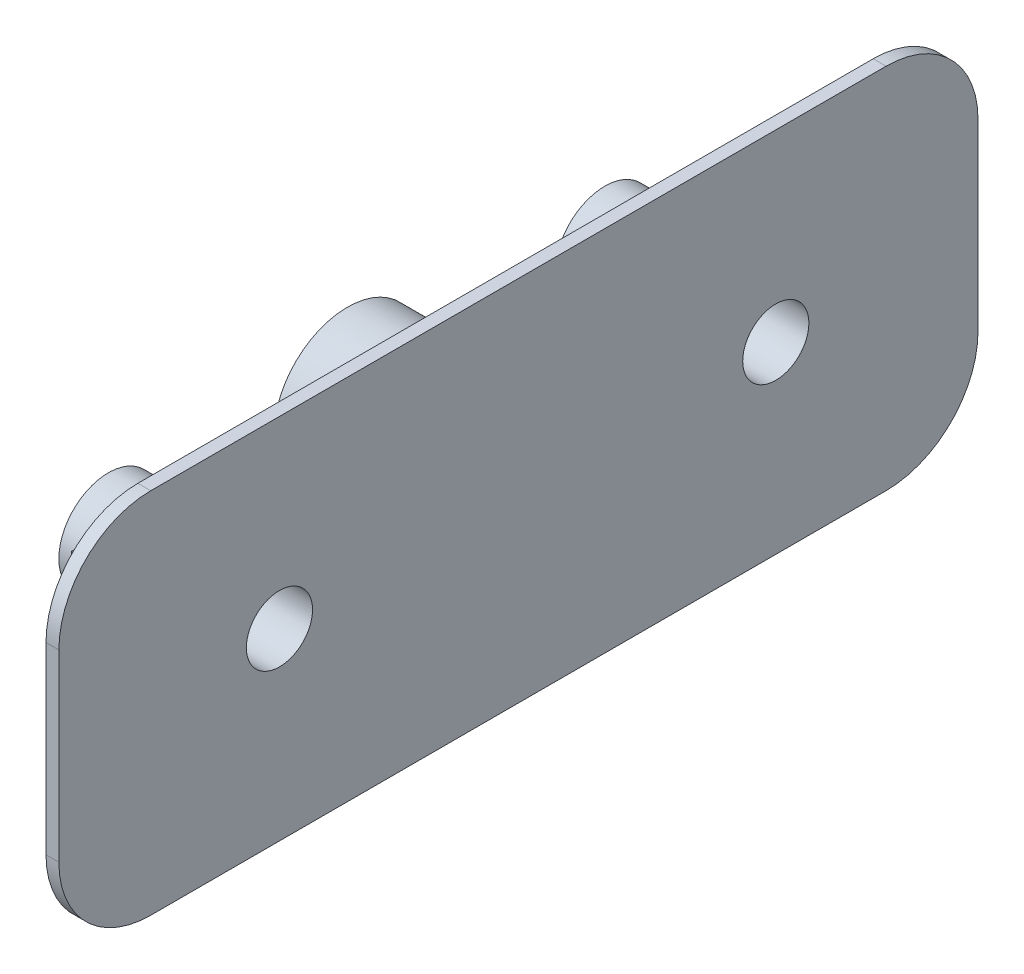
ISO-10303-21;
HEADER;
FILE_DESCRIPTION(('STEP AP214'),'2;1');
FILE_NAME('part.step','',(''),(''),'','','');
FILE_SCHEMA(('AUTOMOTIVE_DESIGN { 1 0 10303 214 1 1 1 1 }'));
ENDSEC;
DATA;
#1=APPLICATION_CONTEXT('core data for automotive mechanical design processes');
#2=APPLICATION_PROTOCOL_DEFINITION('international standard','automotive_design',2000,#1);
#3=PRODUCT_CONTEXT('',#1,'mechanical');
#4=PRODUCT('Part','Part','',(#3));
#5=PRODUCT_RELATED_PRODUCT_CATEGORY('part','',(#4));
#6=PRODUCT_DEFINITION_FORMATION('','',#4);
#7=PRODUCT_DEFINITION_CONTEXT('part definition',#1,'design');
#8=PRODUCT_DEFINITION('design','',#6,#7);
#9=PRODUCT_DEFINITION_SHAPE('','',#8);
#10=(LENGTH_UNIT() NAMED_UNIT(*) SI_UNIT(.MILLI.,.METRE.));
#11=(NAMED_UNIT(*) PLANE_ANGLE_UNIT() SI_UNIT($,.RADIAN.));
#12=(NAMED_UNIT(*) SI_UNIT($,.STERADIAN.) SOLID_ANGLE_UNIT());
#13=UNCERTAINTY_MEASURE_WITH_UNIT(LENGTH_MEASURE(1.E-05),#10,'distance_accuracy_value','');
#14=(GEOMETRIC_REPRESENTATION_CONTEXT(3) GLOBAL_UNCERTAINTY_ASSIGNED_CONTEXT((#13)) GLOBAL_UNIT_ASSIGNED_CONTEXT((#10,
#11,#12)) REPRESENTATION_CONTEXT('',''));
#15=CARTESIAN_POINT('',(0.,0.,0.));
#16=DIRECTION('',(0.,0.,1.));
#17=DIRECTION('',(1.,0.,0.));
#18=AXIS2_PLACEMENT_3D('',#15,#16,#17);
#19=CARTESIAN_POINT('',(5.,0.,0.));
#20=DIRECTION('',(-1.,0.,0.));
#21=DIRECTION('',(0.,0.,1.));
#22=AXIS2_PLACEMENT_3D('',#19,#20,#21);
#23=PLANE('',#22);
#24=CARTESIAN_POINT('',(5.,0.,-14.));
#25=DIRECTION('',(-1.,0.,0.));
#26=DIRECTION('',(0.,0.,1.));
#27=AXIS2_PLACEMENT_3D('',#24,#25,#26);
#28=CIRCLE('',#27,2.7);
#29=CARTESIAN_POINT('',(5.,0.,-11.3));
#30=VERTEX_POINT('',#29);
#31=EDGE_CURVE('E267',#30,#30,#28,.T.);
#32=ORIENTED_EDGE('',*,*,#31,.F.);
#33=EDGE_LOOP('',(#32));
#34=FACE_BOUND('',#33,.T.);
#35=CARTESIAN_POINT('',(5.,0.,0.));
#36=DIRECTION('',(1.,0.,0.));
#37=DIRECTION('',(0.,0.,-1.));
#38=AXIS2_PLACEMENT_3D('',#35,#36,#37);
#39=CIRCLE('',#38,4.);
#40=CARTESIAN_POINT('',(5.,0.,-4.));
#41=VERTEX_POINT('',#40);
#42=EDGE_CURVE('E176',#41,#41,#39,.T.);
#43=ORIENTED_EDGE('',*,*,#42,.T.);
#44=EDGE_LOOP('',(#43));
#45=FACE_BOUND('',#44,.T.);
#46=DIRECTION('',(0.,1.,0.));
#47=VECTOR('',#46,1.);
#48=CARTESIAN_POINT('',(5.,-5.,-20.));
#49=LINE('',#48,#47);
#50=CARTESIAN_POINT('',(5.,-5.,-20.));
#51=VERTEX_POINT('',#50);
#52=CARTESIAN_POINT('',(5.,5.,-20.));
#53=VERTEX_POINT('',#52);
#54=EDGE_CURVE('E159',#51,#53,#49,.T.);
#55=ORIENTED_EDGE('',*,*,#54,.F.);
#56=DIRECTION('',(0.,0.,-1.));
#57=VECTOR('',#56,1.);
#58=CARTESIAN_POINT('',(5.,-5.,20.));
#59=LINE('',#58,#57);
#60=CARTESIAN_POINT('',(5.,-5.,20.));
#61=VERTEX_POINT('',#60);
#62=EDGE_CURVE('E140',#61,#51,#59,.T.);
#63=ORIENTED_EDGE('',*,*,#62,.F.);
#64=DIRECTION('',(0.,-1.,0.));
#65=VECTOR('',#64,1.);
#66=CARTESIAN_POINT('',(5.,-5.,20.));
#67=LINE('',#66,#65);
#68=CARTESIAN_POINT('',(5.,5.,20.));
#69=VERTEX_POINT('',#68);
#70=EDGE_CURVE('E164',#69,#61,#67,.T.);
#71=ORIENTED_EDGE('',*,*,#70,.F.);
#72=DIRECTION('',(0.,0.,1.));
#73=VECTOR('',#72,1.);
#74=CARTESIAN_POINT('',(5.,5.,20.));
#75=LINE('',#74,#73);
#76=EDGE_CURVE('E161',#53,#69,#75,.T.);
#77=ORIENTED_EDGE('',*,*,#76,.F.);
#78=EDGE_LOOP('',(#55,#63,#71,#77));
#79=FACE_BOUND('',#78,.T.);
#80=CARTESIAN_POINT('',(5.,0.,13.));
#81=DIRECTION('',(-1.,0.,0.));
#82=DIRECTION('',(0.,0.,1.));
#83=AXIS2_PLACEMENT_3D('',#80,#81,#82);
#84=CIRCLE('',#83,2.7);
#85=CARTESIAN_POINT('',(5.,0.,15.7));
#86=VERTEX_POINT('',#85);
#87=EDGE_CURVE('E254',#86,#86,#84,.T.);
#88=ORIENTED_EDGE('',*,*,#87,.F.);
#89=EDGE_LOOP('',(#88));
#90=FACE_BOUND('',#89,.T.);
#91=ADVANCED_FACE('F37',(#34,#45,#79,#90),#23,.T.);
#92=CARTESIAN_POINT('',(0.,0.,0.));
#93=DIRECTION('',(1.,0.,0.));
#94=DIRECTION('',(0.,0.,-1.));
#95=AXIS2_PLACEMENT_3D('',#92,#93,#94);
#96=PLANE('',#95);
#97=CARTESIAN_POINT('',(0.,0.,0.));
#98=DIRECTION('',(1.,0.,0.));
#99=DIRECTION('',(0.,0.,-1.));
#100=AXIS2_PLACEMENT_3D('',#97,#98,#99);
#101=CIRCLE('',#100,4.);
#102=CARTESIAN_POINT('',(0.,0.,-4.));
#103=VERTEX_POINT('',#102);
#104=EDGE_CURVE('E175',#103,#103,#101,.T.);
#105=ORIENTED_EDGE('',*,*,#104,.F.);
#106=EDGE_LOOP('',(#105));
#107=FACE_BOUND('',#106,.T.);
#108=CARTESIAN_POINT('',(0.,0.,0.));
#109=DIRECTION('',(1.,0.,0.));
#110=DIRECTION('',(0.,0.,-1.));
#111=AXIS2_PLACEMENT_3D('',#108,#109,#110);
#112=CIRCLE('',#111,3.);
#113=CARTESIAN_POINT('',(0.,0.,-3.));
#114=VERTEX_POINT('',#113);
#115=EDGE_CURVE('E172',#114,#114,#112,.T.);
#116=ORIENTED_EDGE('',*,*,#115,.T.);
#117=EDGE_LOOP('',(#116));
#118=FACE_BOUND('',#117,.T.);
#119=ADVANCED_FACE('F249',(#107,#118),#96,.F.);
#120=CARTESIAN_POINT('',(5.,0.,0.));
#121=DIRECTION('',(-1.,0.,0.));
#122=DIRECTION('',(0.,0.,1.));
#123=AXIS2_PLACEMENT_3D('',#120,#121,#122);
#124=CYLINDRICAL_SURFACE('',#123,4.);
#125=ORIENTED_EDGE('',*,*,#42,.F.);
#126=EDGE_LOOP('',(#125));
#127=FACE_BOUND('',#126,.T.);
#128=ORIENTED_EDGE('',*,*,#104,.T.);
#129=EDGE_LOOP('',(#128));
#130=FACE_BOUND('',#129,.T.);
#131=ADVANCED_FACE('F310',(#127,#130),#124,.T.);
#132=CARTESIAN_POINT('',(5.,0.,0.));
#133=DIRECTION('',(-1.,0.,0.));
#134=DIRECTION('',(0.,0.,1.));
#135=AXIS2_PLACEMENT_3D('',#132,#133,#134);
#136=CYLINDRICAL_SURFACE('',#135,3.);
#137=ORIENTED_EDGE('',*,*,#115,.F.);
#138=EDGE_LOOP('',(#137));
#139=FACE_BOUND('',#138,.T.);
#140=CARTESIAN_POINT('',(8.6,0.,0.));
#141=DIRECTION('',(1.,0.,0.));
#142=DIRECTION('',(0.,0.,-1.));
#143=AXIS2_PLACEMENT_3D('',#140,#141,#142);
#144=CIRCLE('',#143,3.);
#145=CARTESIAN_POINT('',(8.6,0.,-3.));
#146=VERTEX_POINT('',#145);
#147=EDGE_CURVE('E162',#146,#146,#144,.T.);
#148=ORIENTED_EDGE('',*,*,#147,.T.);
#149=EDGE_LOOP('',(#148));
#150=FACE_BOUND('',#149,.T.);
#151=ADVANCED_FACE('F339',(#139,#150),#136,.F.);
#152=CARTESIAN_POINT('',(8.6,-5.,-20.));
#153=DIRECTION('',(0.,0.,1.));
#154=DIRECTION('',(1.,0.,0.));
#155=AXIS2_PLACEMENT_3D('',#152,#153,#154);
#156=PLANE('',#155);
#157=ORIENTED_EDGE('',*,*,#54,.T.);
#158=DIRECTION('',(-1.,0.,0.));
#159=VECTOR('',#158,1.);
#160=CARTESIAN_POINT('',(8.6,5.,-20.));
#161=LINE('',#160,#159);
#162=CARTESIAN_POINT('',(8.6,5.,-20.));
#163=VERTEX_POINT('',#162);
#164=EDGE_CURVE('E135',#163,#53,#161,.T.);
#165=ORIENTED_EDGE('',*,*,#164,.F.);
#166=DIRECTION('',(0.,1.,0.));
#167=VECTOR('',#166,1.);
#168=CARTESIAN_POINT('',(8.6,-5.,-20.));
#169=LINE('',#168,#167);
#170=CARTESIAN_POINT('',(8.6,-5.,-20.));
#171=VERTEX_POINT('',#170);
#172=EDGE_CURVE('E128',#171,#163,#169,.T.);
#173=ORIENTED_EDGE('',*,*,#172,.F.);
#174=DIRECTION('',(-1.,0.,0.));
#175=VECTOR('',#174,1.);
#176=CARTESIAN_POINT('',(8.6,-5.,-20.));
#177=LINE('',#176,#175);
#178=EDGE_CURVE('E132',#171,#51,#177,.T.);
#179=ORIENTED_EDGE('',*,*,#178,.T.);
#180=EDGE_LOOP('',(#157,#165,#173,#179));
#181=FACE_BOUND('',#180,.T.);
#182=ADVANCED_FACE('F131',(#181),#156,.F.);
#183=CARTESIAN_POINT('',(8.6,5.,20.));
#184=DIRECTION('',(0.,-1.,0.));
#185=DIRECTION('',(0.,0.,-1.));
#186=AXIS2_PLACEMENT_3D('',#183,#184,#185);
#187=PLANE('',#186);
#188=ORIENTED_EDGE('',*,*,#76,.T.);
#189=DIRECTION('',(-1.,0.,0.));
#190=VECTOR('',#189,1.);
#191=CARTESIAN_POINT('',(8.6,5.,20.));
#192=LINE('',#191,#190);
#193=CARTESIAN_POINT('',(8.6,5.,20.));
#194=VERTEX_POINT('',#193);
#195=EDGE_CURVE('E168',#194,#69,#192,.T.);
#196=ORIENTED_EDGE('',*,*,#195,.F.);
#197=DIRECTION('',(0.,0.,1.));
#198=VECTOR('',#197,1.);
#199=CARTESIAN_POINT('',(8.6,5.,20.));
#200=LINE('',#199,#198);
#201=EDGE_CURVE('E139',#163,#194,#200,.T.);
#202=ORIENTED_EDGE('',*,*,#201,.F.);
#203=ORIENTED_EDGE('',*,*,#164,.T.);
#204=EDGE_LOOP('',(#188,#196,#202,#203));
#205=FACE_BOUND('',#204,.T.);
#206=ADVANCED_FACE('F242',(#205),#187,.F.);
#207=CARTESIAN_POINT('',(8.6,-5.,20.));
#208=DIRECTION('',(0.,0.,-1.));
#209=DIRECTION('',(-1.,0.,0.));
#210=AXIS2_PLACEMENT_3D('',#207,#208,#209);
#211=PLANE('',#210);
#212=ORIENTED_EDGE('',*,*,#70,.T.);
#213=DIRECTION('',(-1.,0.,0.));
#214=VECTOR('',#213,1.);
#215=CARTESIAN_POINT('',(8.6,-5.,20.));
#216=LINE('',#215,#214);
#217=CARTESIAN_POINT('',(8.6,-5.,20.));
#218=VERTEX_POINT('',#217);
#219=EDGE_CURVE('E149',#218,#61,#216,.T.);
#220=ORIENTED_EDGE('',*,*,#219,.F.);
#221=DIRECTION('',(0.,-1.,0.));
#222=VECTOR('',#221,1.);
#223=CARTESIAN_POINT('',(8.6,-5.,20.));
#224=LINE('',#223,#222);
#225=EDGE_CURVE('E154',#194,#218,#224,.T.);
#226=ORIENTED_EDGE('',*,*,#225,.F.);
#227=ORIENTED_EDGE('',*,*,#195,.T.);
#228=EDGE_LOOP('',(#212,#220,#226,#227));
#229=FACE_BOUND('',#228,.T.);
#230=ADVANCED_FACE('F245',(#229),#211,.F.);
#231=CARTESIAN_POINT('',(8.6,-5.,20.));
#232=DIRECTION('',(0.,1.,0.));
#233=DIRECTION('',(0.,0.,1.));
#234=AXIS2_PLACEMENT_3D('',#231,#232,#233);
#235=PLANE('',#234);
#236=ORIENTED_EDGE('',*,*,#62,.T.);
#237=ORIENTED_EDGE('',*,*,#178,.F.);
#238=DIRECTION('',(0.,0.,-1.));
#239=VECTOR('',#238,1.);
#240=CARTESIAN_POINT('',(8.6,-5.,20.));
#241=LINE('',#240,#239);
#242=EDGE_CURVE('E146',#218,#171,#241,.T.);
#243=ORIENTED_EDGE('',*,*,#242,.F.);
#244=ORIENTED_EDGE('',*,*,#219,.T.);
#245=EDGE_LOOP('',(#236,#237,#243,#244));
#246=FACE_BOUND('',#245,.T.);
#247=ADVANCED_FACE('F144',(#246),#235,.F.);
#248=CARTESIAN_POINT('',(8.6,0.,0.));
#249=DIRECTION('',(1.,0.,0.));
#250=DIRECTION('',(0.,0.,-1.));
#251=AXIS2_PLACEMENT_3D('',#248,#249,#250);
#252=PLANE('',#251);
#253=ORIENTED_EDGE('',*,*,#147,.F.);
#254=EDGE_LOOP('',(#253));
#255=FACE_BOUND('',#254,.T.);
#256=ADVANCED_FACE('F327',(#255),#252,.F.);
#257=CARTESIAN_POINT('',(9.3,-10.,25.));
#258=DIRECTION('',(0.,0.,-1.));
#259=DIRECTION('',(-1.,0.,0.));
#260=AXIS2_PLACEMENT_3D('',#257,#258,#259);
#261=PLANE('',#260);
#262=DIRECTION('',(0.,-1.,0.));
#263=VECTOR('',#262,1.);
#264=CARTESIAN_POINT('',(8.6,-10.,25.));
#265=LINE('',#264,#263);
#266=CARTESIAN_POINT('',(8.6,5.,25.));
#267=VERTEX_POINT('',#266);
#268=CARTESIAN_POINT('',(8.6,-5.,25.));
#269=VERTEX_POINT('',#268);
#270=EDGE_CURVE('E216',#267,#269,#265,.T.);
#271=ORIENTED_EDGE('',*,*,#270,.T.);
#272=DIRECTION('',(-1.,0.,0.));
#273=VECTOR('',#272,1.);
#274=CARTESIAN_POINT('',(9.3,-5.,25.));
#275=LINE('',#274,#273);
#276=CARTESIAN_POINT('',(9.3,-5.,25.));
#277=VERTEX_POINT('',#276);
#278=EDGE_CURVE('E11',#269,#277,#275,.F.);
#279=ORIENTED_EDGE('',*,*,#278,.T.);
#280=DIRECTION('',(0.,-1.,0.));
#281=VECTOR('',#280,1.);
#282=CARTESIAN_POINT('',(9.3,-10.,25.));
#283=LINE('',#282,#281);
#284=CARTESIAN_POINT('',(9.3,5.,25.));
#285=VERTEX_POINT('',#284);
#286=EDGE_CURVE('E218',#285,#277,#283,.T.);
#287=ORIENTED_EDGE('',*,*,#286,.F.);
#288=DIRECTION('',(-1.,0.,0.));
#289=VECTOR('',#288,1.);
#290=CARTESIAN_POINT('',(9.3,5.,25.));
#291=LINE('',#290,#289);
#292=EDGE_CURVE('E45',#285,#267,#291,.T.);
#293=ORIENTED_EDGE('',*,*,#292,.T.);
#294=EDGE_LOOP('',(#271,#279,#287,#293));
#295=FACE_BOUND('',#294,.T.);
#296=ADVANCED_FACE('F215',(#295),#261,.F.);
#297=CARTESIAN_POINT('',(9.3,-10.,-25.));
#298=DIRECTION('',(0.,1.,0.));
#299=DIRECTION('',(0.,0.,1.));
#300=AXIS2_PLACEMENT_3D('',#297,#298,#299);
#301=PLANE('',#300);
#302=DIRECTION('',(0.,0.,-1.));
#303=VECTOR('',#302,1.);
#304=CARTESIAN_POINT('',(8.6,-10.,-25.));
#305=LINE('',#304,#303);
#306=CARTESIAN_POINT('',(8.6,-10.,20.));
#307=VERTEX_POINT('',#306);
#308=CARTESIAN_POINT('',(8.6,-10.,-20.));
#309=VERTEX_POINT('',#308);
#310=EDGE_CURVE('E224',#307,#309,#305,.T.);
#311=ORIENTED_EDGE('',*,*,#310,.T.);
#312=DIRECTION('',(-1.,0.,0.));
#313=VECTOR('',#312,1.);
#314=CARTESIAN_POINT('',(9.3,-10.,-20.));
#315=LINE('',#314,#313);
#316=CARTESIAN_POINT('',(9.3,-10.,-20.));
#317=VERTEX_POINT('',#316);
#318=EDGE_CURVE('E52',#309,#317,#315,.F.);
#319=ORIENTED_EDGE('',*,*,#318,.T.);
#320=DIRECTION('',(0.,0.,-1.));
#321=VECTOR('',#320,1.);
#322=CARTESIAN_POINT('',(9.3,-10.,-25.));
#323=LINE('',#322,#321);
#324=CARTESIAN_POINT('',(9.3,-10.,20.));
#325=VERTEX_POINT('',#324);
#326=EDGE_CURVE('E276',#325,#317,#323,.T.);
#327=ORIENTED_EDGE('',*,*,#326,.F.);
#328=DIRECTION('',(-1.,0.,0.));
#329=VECTOR('',#328,1.);
#330=CARTESIAN_POINT('',(9.3,-10.,20.));
#331=LINE('',#330,#329);
#332=EDGE_CURVE('E206',#325,#307,#331,.T.);
#333=ORIENTED_EDGE('',*,*,#332,.T.);
#334=EDGE_LOOP('',(#311,#319,#327,#333));
#335=FACE_BOUND('',#334,.T.);
#336=ADVANCED_FACE('F318',(#335),#301,.F.);
#337=CARTESIAN_POINT('',(9.3,-10.,-25.));
#338=DIRECTION('',(0.,0.,1.));
#339=DIRECTION('',(1.,0.,0.));
#340=AXIS2_PLACEMENT_3D('',#337,#338,#339);
#341=PLANE('',#340);
#342=DIRECTION('',(0.,1.,0.));
#343=VECTOR('',#342,1.);
#344=CARTESIAN_POINT('',(8.6,-10.,-25.));
#345=LINE('',#344,#343);
#346=CARTESIAN_POINT('',(8.6,-5.,-25.));
#347=VERTEX_POINT('',#346);
#348=CARTESIAN_POINT('',(8.6,5.,-25.));
#349=VERTEX_POINT('',#348);
#350=EDGE_CURVE('E227',#347,#349,#345,.T.);
#351=ORIENTED_EDGE('',*,*,#350,.T.);
#352=DIRECTION('',(-1.,0.,0.));
#353=VECTOR('',#352,1.);
#354=CARTESIAN_POINT('',(9.3,5.,-25.));
#355=LINE('',#354,#353);
#356=CARTESIAN_POINT('',(9.3,5.,-25.));
#357=VERTEX_POINT('',#356);
#358=EDGE_CURVE('E197',#349,#357,#355,.F.);
#359=ORIENTED_EDGE('',*,*,#358,.T.);
#360=DIRECTION('',(0.,1.,0.));
#361=VECTOR('',#360,1.);
#362=CARTESIAN_POINT('',(9.3,-10.,-25.));
#363=LINE('',#362,#361);
#364=CARTESIAN_POINT('',(9.3,-5.,-25.));
#365=VERTEX_POINT('',#364);
#366=EDGE_CURVE('E277',#365,#357,#363,.T.);
#367=ORIENTED_EDGE('',*,*,#366,.F.);
#368=DIRECTION('',(-1.,0.,0.));
#369=VECTOR('',#368,1.);
#370=CARTESIAN_POINT('',(9.3,-5.,-25.));
#371=LINE('',#370,#369);
#372=EDGE_CURVE('E194',#365,#347,#371,.T.);
#373=ORIENTED_EDGE('',*,*,#372,.T.);
#374=EDGE_LOOP('',(#351,#359,#367,#373));
#375=FACE_BOUND('',#374,.T.);
#376=ADVANCED_FACE('F292',(#375),#341,.F.);
#377=CARTESIAN_POINT('',(9.3,10.,-25.));
#378=DIRECTION('',(0.,-1.,0.));
#379=DIRECTION('',(0.,0.,-1.));
#380=AXIS2_PLACEMENT_3D('',#377,#378,#379);
#381=PLANE('',#380);
#382=DIRECTION('',(0.,0.,1.));
#383=VECTOR('',#382,1.);
#384=CARTESIAN_POINT('',(9.3,10.,-25.));
#385=LINE('',#384,#383);
#386=CARTESIAN_POINT('',(9.3,10.,-20.));
#387=VERTEX_POINT('',#386);
#388=CARTESIAN_POINT('',(9.3,9.99999999999999,20.));
#389=VERTEX_POINT('',#388);
#390=EDGE_CURVE('E233',#387,#389,#385,.T.);
#391=ORIENTED_EDGE('',*,*,#390,.F.);
#392=DIRECTION('',(-1.,0.,0.));
#393=VECTOR('',#392,1.);
#394=CARTESIAN_POINT('',(9.3,10.,-20.));
#395=LINE('',#394,#393);
#396=CARTESIAN_POINT('',(8.6,10.,-20.));
#397=VERTEX_POINT('',#396);
#398=EDGE_CURVE('E183',#387,#397,#395,.T.);
#399=ORIENTED_EDGE('',*,*,#398,.T.);
#400=DIRECTION('',(0.,0.,1.));
#401=VECTOR('',#400,1.);
#402=CARTESIAN_POINT('',(8.6,10.,-25.));
#403=LINE('',#402,#401);
#404=CARTESIAN_POINT('',(8.6,9.99999999999999,20.));
#405=VERTEX_POINT('',#404);
#406=EDGE_CURVE('E238',#397,#405,#403,.T.);
#407=ORIENTED_EDGE('',*,*,#406,.T.);
#408=DIRECTION('',(-1.,0.,0.));
#409=VECTOR('',#408,1.);
#410=CARTESIAN_POINT('',(9.3,9.99999999999999,20.));
#411=LINE('',#410,#409);
#412=EDGE_CURVE('E179',#405,#389,#411,.F.);
#413=ORIENTED_EDGE('',*,*,#412,.T.);
#414=EDGE_LOOP('',(#391,#399,#407,#413));
#415=FACE_BOUND('',#414,.T.);
#416=ADVANCED_FACE('F287',(#415),#381,.F.);
#417=CARTESIAN_POINT('',(9.3,0.,0.));
#418=DIRECTION('',(1.,0.,0.));
#419=DIRECTION('',(0.,0.,-1.));
#420=AXIS2_PLACEMENT_3D('',#417,#418,#419);
#421=PLANE('',#420);
#422=CARTESIAN_POINT('',(9.3,0.,-14.));
#423=DIRECTION('',(1.,0.,0.));
#424=DIRECTION('',(0.,0.,-1.));
#425=AXIS2_PLACEMENT_3D('',#422,#423,#424);
#426=CIRCLE('',#425,1.8);
#427=CARTESIAN_POINT('',(9.3,0.,-15.8));
#428=VERTEX_POINT('',#427);
#429=EDGE_CURVE('E230',#428,#428,#426,.T.);
#430=ORIENTED_EDGE('',*,*,#429,.F.);
#431=EDGE_LOOP('',(#430));
#432=FACE_BOUND('',#431,.T.);
#433=CARTESIAN_POINT('',(9.3,0.,13.));
#434=DIRECTION('',(1.,0.,0.));
#435=DIRECTION('',(0.,0.,-1.));
#436=AXIS2_PLACEMENT_3D('',#433,#434,#435);
#437=CIRCLE('',#436,1.8);
#438=CARTESIAN_POINT('',(9.3,0.,11.2));
#439=VERTEX_POINT('',#438);
#440=EDGE_CURVE('E225',#439,#439,#437,.T.);
#441=ORIENTED_EDGE('',*,*,#440,.F.);
#442=EDGE_LOOP('',(#441));
#443=FACE_BOUND('',#442,.T.);
#444=ORIENTED_EDGE('',*,*,#366,.T.);
#445=CARTESIAN_POINT('',(9.3,5.,-20.));
#446=DIRECTION('',(1.,0.,0.));
#447=DIRECTION('',(0.,0.,-1.));
#448=AXIS2_PLACEMENT_3D('',#445,#446,#447);
#449=CIRCLE('',#448,5.);
#450=EDGE_CURVE('E204',#357,#387,#449,.T.);
#451=ORIENTED_EDGE('',*,*,#450,.T.);
#452=ORIENTED_EDGE('',*,*,#390,.T.);
#453=CARTESIAN_POINT('',(9.3,5.,20.));
#454=DIRECTION('',(1.,0.,0.));
#455=DIRECTION('',(0.,0.,-1.));
#456=AXIS2_PLACEMENT_3D('',#453,#454,#455);
#457=CIRCLE('',#456,5.);
#458=EDGE_CURVE('E199',#389,#285,#457,.T.);
#459=ORIENTED_EDGE('',*,*,#458,.T.);
#460=ORIENTED_EDGE('',*,*,#286,.T.);
#461=CARTESIAN_POINT('',(9.3,-5.,20.));
#462=DIRECTION('',(1.,0.,0.));
#463=DIRECTION('',(0.,0.,-1.));
#464=AXIS2_PLACEMENT_3D('',#461,#462,#463);
#465=CIRCLE('',#464,5.);
#466=EDGE_CURVE('E59',#277,#325,#465,.T.);
#467=ORIENTED_EDGE('',*,*,#466,.T.);
#468=ORIENTED_EDGE('',*,*,#326,.T.);
#469=CARTESIAN_POINT('',(9.3,-5.,-20.));
#470=DIRECTION('',(1.,0.,0.));
#471=DIRECTION('',(0.,0.,-1.));
#472=AXIS2_PLACEMENT_3D('',#469,#470,#471);
#473=CIRCLE('',#472,5.);
#474=EDGE_CURVE('E202',#317,#365,#473,.T.);
#475=ORIENTED_EDGE('',*,*,#474,.T.);
#476=EDGE_LOOP('',(#444,#451,#452,#459,#460,#467,#468,#475));
#477=FACE_BOUND('',#476,.T.);
#478=ADVANCED_FACE('F283',(#432,#443,#477),#421,.T.);
#479=ORIENTED_EDGE('',*,*,#242,.T.);
#480=ORIENTED_EDGE('',*,*,#172,.T.);
#481=ORIENTED_EDGE('',*,*,#201,.T.);
#482=ORIENTED_EDGE('',*,*,#225,.T.);
#483=EDGE_LOOP('',(#479,#480,#481,#482));
#484=FACE_BOUND('',#483,.T.);
#485=ORIENTED_EDGE('',*,*,#406,.F.);
#486=CARTESIAN_POINT('',(8.6,5.,-20.));
#487=DIRECTION('',(1.,0.,0.));
#488=DIRECTION('',(0.,0.,-1.));
#489=AXIS2_PLACEMENT_3D('',#486,#487,#488);
#490=CIRCLE('',#489,5.);
#491=EDGE_CURVE('E192',#397,#349,#490,.F.);
#492=ORIENTED_EDGE('',*,*,#491,.T.);
#493=ORIENTED_EDGE('',*,*,#350,.F.);
#494=CARTESIAN_POINT('',(8.6,-5.,-20.));
#495=DIRECTION('',(1.,0.,0.));
#496=DIRECTION('',(0.,0.,-1.));
#497=AXIS2_PLACEMENT_3D('',#494,#495,#496);
#498=CIRCLE('',#497,5.);
#499=EDGE_CURVE('E190',#347,#309,#498,.F.);
#500=ORIENTED_EDGE('',*,*,#499,.T.);
#501=ORIENTED_EDGE('',*,*,#310,.F.);
#502=CARTESIAN_POINT('',(8.6,-5.,20.));
#503=DIRECTION('',(1.,0.,0.));
#504=DIRECTION('',(0.,0.,-1.));
#505=AXIS2_PLACEMENT_3D('',#502,#503,#504);
#506=CIRCLE('',#505,5.);
#507=EDGE_CURVE('E188',#307,#269,#506,.F.);
#508=ORIENTED_EDGE('',*,*,#507,.T.);
#509=ORIENTED_EDGE('',*,*,#270,.F.);
#510=CARTESIAN_POINT('',(8.6,5.,20.));
#511=DIRECTION('',(1.,0.,0.));
#512=DIRECTION('',(0.,0.,-1.));
#513=AXIS2_PLACEMENT_3D('',#510,#511,#512);
#514=CIRCLE('',#513,5.);
#515=EDGE_CURVE('E186',#267,#405,#514,.F.);
#516=ORIENTED_EDGE('',*,*,#515,.T.);
#517=EDGE_LOOP('',(#485,#492,#493,#500,#501,#508,#509,#516));
#518=FACE_BOUND('',#517,.T.);
#519=ADVANCED_FACE('F151',(#484,#518),#252,.F.);
#520=CARTESIAN_POINT('',(5.,0.,13.));
#521=DIRECTION('',(-1.,0.,0.));
#522=DIRECTION('',(0.,0.,1.));
#523=AXIS2_PLACEMENT_3D('',#520,#521,#522);
#524=CYLINDRICAL_SURFACE('',#523,1.8);
#525=ORIENTED_EDGE('',*,*,#440,.T.);
#526=EDGE_LOOP('',(#525));
#527=FACE_BOUND('',#526,.T.);
#528=CARTESIAN_POINT('',(0.,0.,13.));
#529=DIRECTION('',(-1.,0.,0.));
#530=DIRECTION('',(0.,0.,1.));
#531=AXIS2_PLACEMENT_3D('',#528,#529,#530);
#532=CIRCLE('',#531,1.8);
#533=CARTESIAN_POINT('',(0.,0.,14.8));
#534=VERTEX_POINT('',#533);
#535=EDGE_CURVE('E256',#534,#534,#532,.T.);
#536=ORIENTED_EDGE('',*,*,#535,.T.);
#537=EDGE_LOOP('',(#536));
#538=FACE_BOUND('',#537,.T.);
#539=ADVANCED_FACE('F360',(#527,#538),#524,.F.);
#540=CARTESIAN_POINT('',(5.,0.,-14.));
#541=DIRECTION('',(-1.,0.,0.));
#542=DIRECTION('',(0.,0.,1.));
#543=AXIS2_PLACEMENT_3D('',#540,#541,#542);
#544=CYLINDRICAL_SURFACE('',#543,1.8);
#545=ORIENTED_EDGE('',*,*,#429,.T.);
#546=EDGE_LOOP('',(#545));
#547=FACE_BOUND('',#546,.T.);
#548=CARTESIAN_POINT('',(0.,0.,-14.));
#549=DIRECTION('',(-1.,0.,0.));
#550=DIRECTION('',(0.,0.,1.));
#551=AXIS2_PLACEMENT_3D('',#548,#549,#550);
#552=CIRCLE('',#551,1.8);
#553=CARTESIAN_POINT('',(0.,0.,-12.2));
#554=VERTEX_POINT('',#553);
#555=EDGE_CURVE('E260',#554,#554,#552,.T.);
#556=ORIENTED_EDGE('',*,*,#555,.T.);
#557=EDGE_LOOP('',(#556));
#558=FACE_BOUND('',#557,.T.);
#559=ADVANCED_FACE('F365',(#547,#558),#544,.F.);
#560=CARTESIAN_POINT('',(0.,0.,-14.));
#561=DIRECTION('',(-1.,0.,0.));
#562=DIRECTION('',(0.,0.,1.));
#563=AXIS2_PLACEMENT_3D('',#560,#561,#562);
#564=PLANE('',#563);
#565=CARTESIAN_POINT('',(0.,0.,-14.));
#566=DIRECTION('',(-1.,0.,0.));
#567=DIRECTION('',(0.,0.,1.));
#568=AXIS2_PLACEMENT_3D('',#565,#566,#567);
#569=CIRCLE('',#568,2.7);
#570=CARTESIAN_POINT('',(0.,0.,-11.3));
#571=VERTEX_POINT('',#570);
#572=EDGE_CURVE('E268',#571,#571,#569,.T.);
#573=ORIENTED_EDGE('',*,*,#572,.T.);
#574=EDGE_LOOP('',(#573));
#575=FACE_BOUND('',#574,.T.);
#576=ORIENTED_EDGE('',*,*,#555,.F.);
#577=EDGE_LOOP('',(#576));
#578=FACE_BOUND('',#577,.T.);
#579=ADVANCED_FACE('F377',(#575,#578),#564,.T.);
#580=CARTESIAN_POINT('',(0.,0.,-14.));
#581=DIRECTION('',(1.,0.,0.));
#582=DIRECTION('',(0.,0.,-1.));
#583=AXIS2_PLACEMENT_3D('',#580,#581,#582);
#584=CYLINDRICAL_SURFACE('',#583,2.7);
#585=ORIENTED_EDGE('',*,*,#572,.F.);
#586=EDGE_LOOP('',(#585));
#587=FACE_BOUND('',#586,.T.);
#588=ORIENTED_EDGE('',*,*,#31,.T.);
#589=EDGE_LOOP('',(#588));
#590=FACE_BOUND('',#589,.T.);
#591=ADVANCED_FACE('F379',(#587,#590),#584,.T.);
#592=CARTESIAN_POINT('',(0.,0.,13.));
#593=DIRECTION('',(-1.,0.,0.));
#594=DIRECTION('',(0.,0.,1.));
#595=AXIS2_PLACEMENT_3D('',#592,#593,#594);
#596=PLANE('',#595);
#597=CARTESIAN_POINT('',(0.,0.,13.));
#598=DIRECTION('',(-1.,0.,0.));
#599=DIRECTION('',(0.,0.,1.));
#600=AXIS2_PLACEMENT_3D('',#597,#598,#599);
#601=CIRCLE('',#600,2.7);
#602=CARTESIAN_POINT('',(0.,0.,15.7));
#603=VERTEX_POINT('',#602);
#604=EDGE_CURVE('E257',#603,#603,#601,.T.);
#605=ORIENTED_EDGE('',*,*,#604,.T.);
#606=EDGE_LOOP('',(#605));
#607=FACE_BOUND('',#606,.T.);
#608=ORIENTED_EDGE('',*,*,#535,.F.);
#609=EDGE_LOOP('',(#608));
#610=FACE_BOUND('',#609,.T.);
#611=ADVANCED_FACE('F306',(#607,#610),#596,.T.);
#612=CARTESIAN_POINT('',(0.,0.,13.));
#613=DIRECTION('',(1.,0.,0.));
#614=DIRECTION('',(0.,0.,-1.));
#615=AXIS2_PLACEMENT_3D('',#612,#613,#614);
#616=CYLINDRICAL_SURFACE('',#615,2.7);
#617=ORIENTED_EDGE('',*,*,#604,.F.);
#618=EDGE_LOOP('',(#617));
#619=FACE_BOUND('',#618,.T.);
#620=ORIENTED_EDGE('',*,*,#87,.T.);
#621=EDGE_LOOP('',(#620));
#622=FACE_BOUND('',#621,.T.);
#623=ADVANCED_FACE('F297',(#619,#622),#616,.T.);
#624=CARTESIAN_POINT('',(9.3,5.,-20.));
#625=DIRECTION('',(-1.,0.,0.));
#626=DIRECTION('',(0.,0.,1.));
#627=AXIS2_PLACEMENT_3D('',#624,#625,#626);
#628=CYLINDRICAL_SURFACE('',#627,5.);
#629=ORIENTED_EDGE('',*,*,#450,.F.);
#630=ORIENTED_EDGE('',*,*,#358,.F.);
#631=ORIENTED_EDGE('',*,*,#491,.F.);
#632=ORIENTED_EDGE('',*,*,#398,.F.);
#633=EDGE_LOOP('',(#629,#630,#631,#632));
#634=FACE_BOUND('',#633,.T.);
#635=ADVANCED_FACE('F294',(#634),#628,.T.);
#636=CARTESIAN_POINT('',(9.3,-5.,-20.));
#637=DIRECTION('',(-1.,0.,0.));
#638=DIRECTION('',(0.,0.,1.));
#639=AXIS2_PLACEMENT_3D('',#636,#637,#638);
#640=CYLINDRICAL_SURFACE('',#639,5.);
#641=ORIENTED_EDGE('',*,*,#474,.F.);
#642=ORIENTED_EDGE('',*,*,#318,.F.);
#643=ORIENTED_EDGE('',*,*,#499,.F.);
#644=ORIENTED_EDGE('',*,*,#372,.F.);
#645=EDGE_LOOP('',(#641,#642,#643,#644));
#646=FACE_BOUND('',#645,.T.);
#647=ADVANCED_FACE('F296',(#646),#640,.T.);
#648=CARTESIAN_POINT('',(9.3,-5.,20.));
#649=DIRECTION('',(-1.,0.,0.));
#650=DIRECTION('',(0.,0.,1.));
#651=AXIS2_PLACEMENT_3D('',#648,#649,#650);
#652=CYLINDRICAL_SURFACE('',#651,5.);
#653=ORIENTED_EDGE('',*,*,#466,.F.);
#654=ORIENTED_EDGE('',*,*,#278,.F.);
#655=ORIENTED_EDGE('',*,*,#507,.F.);
#656=ORIENTED_EDGE('',*,*,#332,.F.);
#657=EDGE_LOOP('',(#653,#654,#655,#656));
#658=FACE_BOUND('',#657,.T.);
#659=ADVANCED_FACE('F303',(#658),#652,.T.);
#660=CARTESIAN_POINT('',(9.3,5.,20.));
#661=DIRECTION('',(-1.,0.,0.));
#662=DIRECTION('',(0.,0.,1.));
#663=AXIS2_PLACEMENT_3D('',#660,#661,#662);
#664=CYLINDRICAL_SURFACE('',#663,5.);
#665=ORIENTED_EDGE('',*,*,#458,.F.);
#666=ORIENTED_EDGE('',*,*,#412,.F.);
#667=ORIENTED_EDGE('',*,*,#515,.F.);
#668=ORIENTED_EDGE('',*,*,#292,.F.);
#669=EDGE_LOOP('',(#665,#666,#667,#668));
#670=FACE_BOUND('',#669,.T.);
#671=ADVANCED_FACE('F39',(#670),#664,.T.);
#672=CLOSED_SHELL('',(#91,#119,#131,#151,#182,#206,#230,#247,#256,#296,#336,#376,#416,#478,#519,
#539,#559,#579,#591,#611,#623,#635,#647,#659,#671));
#673=MANIFOLD_SOLID_BREP('B2',#672);
#674=ADVANCED_BREP_SHAPE_REPRESENTATION('',(#18,#673),#14);
#675=SHAPE_DEFINITION_REPRESENTATION(#9,#674);
ENDSEC;
END-ISO-10303-21;
